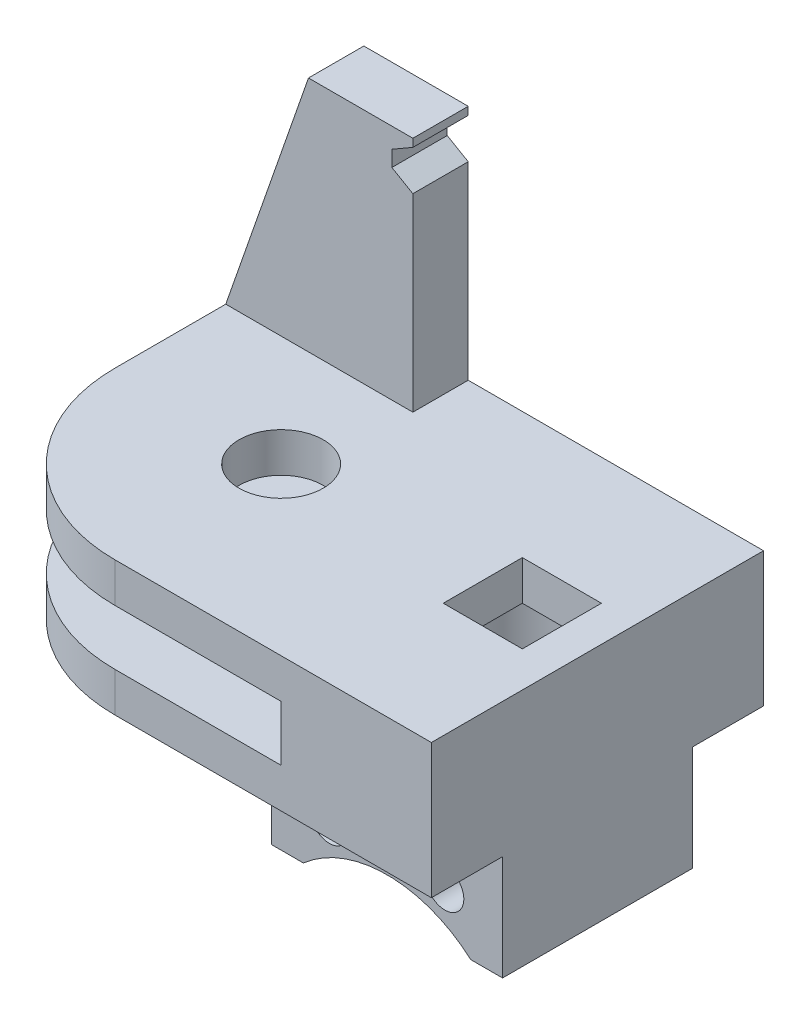
ISO-10303-21;
HEADER;
FILE_DESCRIPTION(('STEP AP214'),'2;1');
FILE_NAME('part.step','',(''),(''),'','','');
FILE_SCHEMA(('AUTOMOTIVE_DESIGN { 1 0 10303 214 1 1 1 1 }'));
ENDSEC;
DATA;
#1=APPLICATION_CONTEXT('core data for automotive mechanical design processes');
#2=APPLICATION_PROTOCOL_DEFINITION('international standard','automotive_design',2000,#1);
#3=PRODUCT_CONTEXT('',#1,'mechanical');
#4=PRODUCT('Part','Part','',(#3));
#5=PRODUCT_RELATED_PRODUCT_CATEGORY('part','',(#4));
#6=PRODUCT_DEFINITION_FORMATION('','',#4);
#7=PRODUCT_DEFINITION_CONTEXT('part definition',#1,'design');
#8=PRODUCT_DEFINITION('design','',#6,#7);
#9=PRODUCT_DEFINITION_SHAPE('','',#8);
#10=(LENGTH_UNIT() NAMED_UNIT(*) SI_UNIT(.MILLI.,.METRE.));
#11=(NAMED_UNIT(*) PLANE_ANGLE_UNIT() SI_UNIT($,.RADIAN.));
#12=(NAMED_UNIT(*) SI_UNIT($,.STERADIAN.) SOLID_ANGLE_UNIT());
#13=UNCERTAINTY_MEASURE_WITH_UNIT(LENGTH_MEASURE(1.E-05),#10,'distance_accuracy_value','');
#14=(GEOMETRIC_REPRESENTATION_CONTEXT(3) GLOBAL_UNCERTAINTY_ASSIGNED_CONTEXT((#13)) GLOBAL_UNIT_ASSIGNED_CONTEXT((#10,
#11,#12)) REPRESENTATION_CONTEXT('',''));
#15=CARTESIAN_POINT('',(0.,0.,0.));
#16=DIRECTION('',(0.,0.,1.));
#17=DIRECTION('',(1.,0.,0.));
#18=AXIS2_PLACEMENT_3D('',#15,#16,#17);
#19=CARTESIAN_POINT('',(1.6891,22.225,-13.335));
#20=DIRECTION('',(-1.,0.,0.));
#21=DIRECTION('',(0.,0.,1.));
#22=AXIS2_PLACEMENT_3D('',#19,#20,#21);
#23=PLANE('',#22);
#24=DIRECTION('',(0.,-1.,0.));
#25=VECTOR('',#24,1.);
#26=CARTESIAN_POINT('',(1.6891,22.225,-8.89));
#27=LINE('',#26,#25);
#28=CARTESIAN_POINT('',(1.6891,22.225,-8.89));
#29=VERTEX_POINT('',#28);
#30=CARTESIAN_POINT('',(1.6891,21.59,-8.89));
#31=VERTEX_POINT('',#30);
#32=EDGE_CURVE('E235',#29,#31,#27,.T.);
#33=ORIENTED_EDGE('',*,*,#32,.T.);
#34=DIRECTION('',(0.,0.,1.));
#35=VECTOR('',#34,1.);
#36=CARTESIAN_POINT('',(1.6891,21.59,-21.59));
#37=LINE('',#36,#35);
#38=CARTESIAN_POINT('',(1.6891,21.59,-13.335));
#39=VERTEX_POINT('',#38);
#40=EDGE_CURVE('E229',#39,#31,#37,.T.);
#41=ORIENTED_EDGE('',*,*,#40,.F.);
#42=DIRECTION('',(0.,-1.,0.));
#43=VECTOR('',#42,1.);
#44=CARTESIAN_POINT('',(1.6891,22.225,-13.335));
#45=LINE('',#44,#43);
#46=CARTESIAN_POINT('',(1.6891,22.225,-13.335));
#47=VERTEX_POINT('',#46);
#48=EDGE_CURVE('E244',#47,#39,#45,.T.);
#49=ORIENTED_EDGE('',*,*,#48,.F.);
#50=DIRECTION('',(0.,0.,-1.));
#51=VECTOR('',#50,1.);
#52=CARTESIAN_POINT('',(1.6891,22.225,-13.335));
#53=LINE('',#52,#51);
#54=EDGE_CURVE('E786',#29,#47,#53,.T.);
#55=ORIENTED_EDGE('',*,*,#54,.F.);
#56=EDGE_LOOP('',(#33,#41,#49,#55));
#57=FACE_BOUND('',#56,.T.);
#58=ADVANCED_FACE('F34',(#57),#23,.F.);
#59=CARTESIAN_POINT('',(0.,3.175,0.));
#60=DIRECTION('',(0.,1.,0.));
#61=DIRECTION('',(0.,0.,1.));
#62=AXIS2_PLACEMENT_3D('',#59,#60,#61);
#63=PLANE('',#62);
#64=DIRECTION('',(0.,0.,-1.));
#65=VECTOR('',#64,1.);
#66=CARTESIAN_POINT('',(22.5425,3.175,3.175));
#67=LINE('',#66,#65);
#68=CARTESIAN_POINT('',(22.5425,3.175,3.175));
#69=VERTEX_POINT('',#68);
#70=CARTESIAN_POINT('',(22.5425,3.175,-3.175));
#71=VERTEX_POINT('',#70);
#72=EDGE_CURVE('E288',#69,#71,#67,.T.);
#73=ORIENTED_EDGE('',*,*,#72,.F.);
#74=DIRECTION('',(1.,0.,0.));
#75=VECTOR('',#74,1.);
#76=CARTESIAN_POINT('',(16.1925,3.175,3.175));
#77=LINE('',#76,#75);
#78=CARTESIAN_POINT('',(16.1925,3.175,3.175));
#79=VERTEX_POINT('',#78);
#80=EDGE_CURVE('E297',#79,#69,#77,.T.);
#81=ORIENTED_EDGE('',*,*,#80,.F.);
#82=DIRECTION('',(0.,0.,1.));
#83=VECTOR('',#82,1.);
#84=CARTESIAN_POINT('',(16.1925,3.175,3.175));
#85=LINE('',#84,#83);
#86=CARTESIAN_POINT('',(16.1925,3.175,-3.175));
#87=VERTEX_POINT('',#86);
#88=EDGE_CURVE('E294',#87,#79,#85,.T.);
#89=ORIENTED_EDGE('',*,*,#88,.F.);
#90=DIRECTION('',(-1.,0.,0.));
#91=VECTOR('',#90,1.);
#92=CARTESIAN_POINT('',(16.1925,3.175,-3.175));
#93=LINE('',#92,#91);
#94=EDGE_CURVE('E291',#71,#87,#93,.T.);
#95=ORIENTED_EDGE('',*,*,#94,.F.);
#96=EDGE_LOOP('',(#73,#81,#89,#95));
#97=FACE_BOUND('',#96,.T.);
#98=CARTESIAN_POINT('',(0.,3.175,0.));
#99=DIRECTION('',(0.,1.,0.));
#100=DIRECTION('',(0.,0.,1.));
#101=AXIS2_PLACEMENT_3D('',#98,#99,#100);
#102=CIRCLE('',#101,3.3782);
#103=CARTESIAN_POINT('',(0.,3.175,3.3782));
#104=VERTEX_POINT('',#103);
#105=EDGE_CURVE('E399',#104,#104,#102,.T.);
#106=ORIENTED_EDGE('',*,*,#105,.F.);
#107=EDGE_LOOP('',(#106));
#108=FACE_BOUND('',#107,.T.);
#109=DIRECTION('',(1.,0.,0.));
#110=VECTOR('',#109,1.);
#111=CARTESIAN_POINT('',(1.6891,3.175,-8.89));
#112=LINE('',#111,#110);
#113=CARTESIAN_POINT('',(-13.335,3.175,-8.89));
#114=VERTEX_POINT('',#113);
#115=CARTESIAN_POINT('',(1.6891,3.175,-8.89));
#116=VERTEX_POINT('',#115);
#117=EDGE_CURVE('E234',#114,#116,#112,.T.);
#118=ORIENTED_EDGE('',*,*,#117,.F.);
#119=DIRECTION('',(0.,0.,1.));
#120=VECTOR('',#119,1.);
#121=CARTESIAN_POINT('',(-13.335,3.175,-13.335));
#122=LINE('',#121,#120);
#123=CARTESIAN_POINT('',(-13.335,3.175,0.));
#124=VERTEX_POINT('',#123);
#125=EDGE_CURVE('E251',#114,#124,#122,.T.);
#126=ORIENTED_EDGE('',*,*,#125,.T.);
#127=CARTESIAN_POINT('',(0.,3.175,0.));
#128=DIRECTION('',(0.,1.,0.));
#129=DIRECTION('',(0.,0.,1.));
#130=AXIS2_PLACEMENT_3D('',#127,#128,#129);
#131=CIRCLE('',#130,13.335);
#132=CARTESIAN_POINT('',(0.,3.175,13.335));
#133=VERTEX_POINT('',#132);
#134=EDGE_CURVE('E405',#124,#133,#131,.T.);
#135=ORIENTED_EDGE('',*,*,#134,.T.);
#136=DIRECTION('',(1.,0.,0.));
#137=VECTOR('',#136,1.);
#138=CARTESIAN_POINT('',(0.,3.175,13.335));
#139=LINE('',#138,#137);
#140=CARTESIAN_POINT('',(25.4,3.175,13.335));
#141=VERTEX_POINT('',#140);
#142=EDGE_CURVE('E407',#133,#141,#139,.T.);
#143=ORIENTED_EDGE('',*,*,#142,.T.);
#144=DIRECTION('',(0.,0.,1.));
#145=VECTOR('',#144,1.);
#146=CARTESIAN_POINT('',(25.4,3.175,0.));
#147=LINE('',#146,#145);
#148=CARTESIAN_POINT('',(25.4,3.175,-13.335));
#149=VERTEX_POINT('',#148);
#150=EDGE_CURVE('E409',#149,#141,#147,.T.);
#151=ORIENTED_EDGE('',*,*,#150,.F.);
#152=DIRECTION('',(1.,0.,0.));
#153=VECTOR('',#152,1.);
#154=CARTESIAN_POINT('',(0.,3.175,-13.335));
#155=LINE('',#154,#153);
#156=CARTESIAN_POINT('',(1.6891,3.175,-13.335));
#157=VERTEX_POINT('',#156);
#158=EDGE_CURVE('E402',#157,#149,#155,.T.);
#159=ORIENTED_EDGE('',*,*,#158,.F.);
#160=DIRECTION('',(0.,0.,-1.));
#161=VECTOR('',#160,1.);
#162=CARTESIAN_POINT('',(1.6891,3.175,-13.335));
#163=LINE('',#162,#161);
#164=EDGE_CURVE('E790',#116,#157,#163,.T.);
#165=ORIENTED_EDGE('',*,*,#164,.F.);
#166=EDGE_LOOP('',(#118,#126,#135,#143,#151,#159,#165));
#167=FACE_BOUND('',#166,.T.);
#168=ADVANCED_FACE('F485',(#97,#108,#167),#63,.T.);
#169=CARTESIAN_POINT('',(0.,-16.05915,0.));
#170=DIRECTION('',(0.,-1.,0.));
#171=DIRECTION('',(0.,0.,-1.));
#172=AXIS2_PLACEMENT_3D('',#169,#170,#171);
#173=PLANE('',#172);
#174=DIRECTION('',(0.,0.,-1.));
#175=VECTOR('',#174,1.);
#176=CARTESIAN_POINT('',(9.40879166989593,-16.05915,13.335));
#177=LINE('',#176,#175);
#178=CARTESIAN_POINT('',(9.40879166989593,-16.05915,7.62000000000001));
#179=VERTEX_POINT('',#178);
#180=CARTESIAN_POINT('',(9.40879166989593,-16.05915,-7.62));
#181=VERTEX_POINT('',#180);
#182=EDGE_CURVE('E42',#179,#181,#177,.T.);
#183=ORIENTED_EDGE('',*,*,#182,.F.);
#184=DIRECTION('',(-1.,0.,0.));
#185=VECTOR('',#184,1.);
#186=CARTESIAN_POINT('',(25.4,-16.05915,7.62000000000001));
#187=LINE('',#186,#185);
#188=CARTESIAN_POINT('',(6.858,-16.05915,7.62000000000001));
#189=VERTEX_POINT('',#188);
#190=EDGE_CURVE('E329',#179,#189,#187,.T.);
#191=ORIENTED_EDGE('',*,*,#190,.T.);
#192=DIRECTION('',(0.,0.,-1.));
#193=VECTOR('',#192,1.);
#194=CARTESIAN_POINT('',(6.858,-16.05915,-7.62000000000001));
#195=LINE('',#194,#193);
#196=CARTESIAN_POINT('',(6.858,-16.05915,-7.62000000000001));
#197=VERTEX_POINT('',#196);
#198=EDGE_CURVE('E334',#189,#197,#195,.T.);
#199=ORIENTED_EDGE('',*,*,#198,.T.);
#200=DIRECTION('',(1.,0.,0.));
#201=VECTOR('',#200,1.);
#202=CARTESIAN_POINT('',(25.4,-16.05915,-7.62));
#203=LINE('',#202,#201);
#204=EDGE_CURVE('E337',#197,#181,#203,.T.);
#205=ORIENTED_EDGE('',*,*,#204,.T.);
#206=EDGE_LOOP('',(#183,#191,#199,#205));
#207=FACE_BOUND('',#206,.T.);
#208=ADVANCED_FACE('F442',(#207),#173,.T.);
#209=CARTESIAN_POINT('',(0.,3.175,-13.335));
#210=DIRECTION('',(0.,0.,-1.));
#211=DIRECTION('',(-1.,0.,0.));
#212=AXIS2_PLACEMENT_3D('',#209,#210,#211);
#213=PLANE('',#212);
#214=DIRECTION('',(0.866025403784441,0.499999999999997,0.));
#215=VECTOR('',#214,1.);
#216=CARTESIAN_POINT('',(-7.55165390534519,16.2548482452339,-13.335));
#217=LINE('',#216,#215);
#218=CARTESIAN_POINT('',(0.,20.6147976603118,-13.335));
#219=VERTEX_POINT('',#218);
#220=EDGE_CURVE('E767',#219,#39,#217,.T.);
#221=ORIENTED_EDGE('',*,*,#220,.F.);
#222=DIRECTION('',(0.,1.,0.));
#223=VECTOR('',#222,1.);
#224=CARTESIAN_POINT('',(0.,3.175,-13.335));
#225=LINE('',#224,#223);
#226=CARTESIAN_POINT('',(0.,19.3447976603118,-13.335));
#227=VERTEX_POINT('',#226);
#228=EDGE_CURVE('E773',#227,#219,#225,.T.);
#229=ORIENTED_EDGE('',*,*,#228,.F.);
#230=DIRECTION('',(-0.866025403784436,0.500000000000005,0.));
#231=VECTOR('',#230,1.);
#232=CARTESIAN_POINT('',(7.00172777394215,15.3023482452338,-13.335));
#233=LINE('',#232,#231);
#234=CARTESIAN_POINT('',(1.6891,18.3695953206236,-13.335));
#235=VERTEX_POINT('',#234);
#236=EDGE_CURVE('E774',#235,#227,#233,.T.);
#237=ORIENTED_EDGE('',*,*,#236,.F.);
#238=EDGE_CURVE('E228',#235,#157,#45,.T.);
#239=ORIENTED_EDGE('',*,*,#238,.T.);
#240=ORIENTED_EDGE('',*,*,#158,.T.);
#241=DIRECTION('',(0.,-1.,0.));
#242=VECTOR('',#241,1.);
#243=CARTESIAN_POINT('',(25.4,3.175,-13.335));
#244=LINE('',#243,#242);
#245=CARTESIAN_POINT('',(25.4,-7.62,-13.335));
#246=VERTEX_POINT('',#245);
#247=EDGE_CURVE('E412',#149,#246,#244,.T.);
#248=ORIENTED_EDGE('',*,*,#247,.T.);
#249=DIRECTION('',(1.,0.,0.));
#250=VECTOR('',#249,1.);
#251=CARTESIAN_POINT('',(0.,-7.62,-13.335));
#252=LINE('',#251,#250);
#253=CARTESIAN_POINT('',(-13.335,-7.62,-13.335));
#254=VERTEX_POINT('',#253);
#255=EDGE_CURVE('E363',#254,#246,#252,.T.);
#256=ORIENTED_EDGE('',*,*,#255,.F.);
#257=DIRECTION('',(0.,-1.,0.));
#258=VECTOR('',#257,1.);
#259=CARTESIAN_POINT('',(-13.335,14.4135378542452,-13.335));
#260=LINE('',#259,#258);
#261=CARTESIAN_POINT('',(-13.335,-4.445,-13.335));
#262=VERTEX_POINT('',#261);
#263=EDGE_CURVE('E252',#262,#254,#260,.T.);
#264=ORIENTED_EDGE('',*,*,#263,.F.);
#265=DIRECTION('',(1.,0.,0.));
#266=VECTOR('',#265,1.);
#267=CARTESIAN_POINT('',(0.,-4.445,-13.335));
#268=LINE('',#267,#266);
#269=CARTESIAN_POINT('',(13.335,-4.445,-13.335));
#270=VERTEX_POINT('',#269);
#271=EDGE_CURVE('E378',#262,#270,#268,.T.);
#272=ORIENTED_EDGE('',*,*,#271,.T.);
#273=DIRECTION('',(0.,1.,0.));
#274=VECTOR('',#273,1.);
#275=CARTESIAN_POINT('',(13.335,-4.445,-13.335));
#276=LINE('',#275,#274);
#277=CARTESIAN_POINT('',(13.335,0.,-13.335));
#278=VERTEX_POINT('',#277);
#279=EDGE_CURVE('E391',#270,#278,#276,.T.);
#280=ORIENTED_EDGE('',*,*,#279,.T.);
#281=DIRECTION('',(1.,0.,0.));
#282=VECTOR('',#281,1.);
#283=CARTESIAN_POINT('',(0.,0.,-13.335));
#284=LINE('',#283,#282);
#285=CARTESIAN_POINT('',(-13.335,0.,-13.335));
#286=VERTEX_POINT('',#285);
#287=EDGE_CURVE('E415',#286,#278,#284,.T.);
#288=ORIENTED_EDGE('',*,*,#287,.F.);
#289=DIRECTION('',(0.,1.,0.));
#290=VECTOR('',#289,1.);
#291=CARTESIAN_POINT('',(-13.335,-18.8585378542452,-13.335));
#292=LINE('',#291,#290);
#293=CARTESIAN_POINT('',(-13.335,3.175,-13.335));
#294=VERTEX_POINT('',#293);
#295=EDGE_CURVE('E263',#286,#294,#292,.T.);
#296=ORIENTED_EDGE('',*,*,#295,.T.);
#297=DIRECTION('',(-0.329228587622184,-0.944250251306454,0.));
#298=VECTOR('',#297,1.);
#299=CARTESIAN_POINT('',(-6.6929,22.225,-13.335));
#300=LINE('',#299,#298);
#301=CARTESIAN_POINT('',(-6.6929,22.225,-13.335));
#302=VERTEX_POINT('',#301);
#303=EDGE_CURVE('E783',#302,#294,#300,.T.);
#304=ORIENTED_EDGE('',*,*,#303,.F.);
#305=DIRECTION('',(-1.,0.,0.));
#306=VECTOR('',#305,1.);
#307=CARTESIAN_POINT('',(1.6891,22.225,-13.335));
#308=LINE('',#307,#306);
#309=EDGE_CURVE('E781',#47,#302,#308,.T.);
#310=ORIENTED_EDGE('',*,*,#309,.F.);
#311=ORIENTED_EDGE('',*,*,#48,.T.);
#312=EDGE_LOOP('',(#221,#229,#237,#239,#240,#248,#256,#264,#272,#280,#288,#296,#304,#310,#311));
#313=FACE_BOUND('',#312,.T.);
#314=ADVANCED_FACE('F482',(#313),#213,.T.);
#315=CARTESIAN_POINT('',(0.,3.175,0.));
#316=DIRECTION('',(0.,-1.,0.));
#317=DIRECTION('',(0.,0.,-1.));
#318=AXIS2_PLACEMENT_3D('',#315,#316,#317);
#319=CYLINDRICAL_SURFACE('',#318,13.335);
#320=ORIENTED_EDGE('',*,*,#134,.F.);
#321=DIRECTION('',(0.,1.,0.));
#322=VECTOR('',#321,1.);
#323=CARTESIAN_POINT('',(-13.335,-18.8585378542452,0.));
#324=LINE('',#323,#322);
#325=CARTESIAN_POINT('',(-13.335,0.,0.));
#326=VERTEX_POINT('',#325);
#327=EDGE_CURVE('E264',#326,#124,#324,.T.);
#328=ORIENTED_EDGE('',*,*,#327,.F.);
#329=CARTESIAN_POINT('',(0.,0.,0.));
#330=DIRECTION('',(0.,1.,0.));
#331=DIRECTION('',(0.,0.,1.));
#332=AXIS2_PLACEMENT_3D('',#329,#330,#331);
#333=CIRCLE('',#332,13.335);
#334=CARTESIAN_POINT('',(0.,0.,13.335));
#335=VERTEX_POINT('',#334);
#336=EDGE_CURVE('E418',#326,#335,#333,.T.);
#337=ORIENTED_EDGE('',*,*,#336,.T.);
#338=DIRECTION('',(0.,-1.,0.));
#339=VECTOR('',#338,1.);
#340=CARTESIAN_POINT('',(0.,3.175,13.335));
#341=LINE('',#340,#339);
#342=EDGE_CURVE('E426',#133,#335,#341,.T.);
#343=ORIENTED_EDGE('',*,*,#342,.F.);
#344=EDGE_LOOP('',(#320,#328,#337,#343));
#345=FACE_BOUND('',#344,.T.);
#346=ADVANCED_FACE('F489',(#345),#319,.T.);
#347=CARTESIAN_POINT('',(0.,3.175,13.335));
#348=DIRECTION('',(0.,0.,-1.));
#349=DIRECTION('',(-1.,0.,0.));
#350=AXIS2_PLACEMENT_3D('',#347,#348,#349);
#351=PLANE('',#350);
#352=DIRECTION('',(1.,0.,0.));
#353=VECTOR('',#352,1.);
#354=CARTESIAN_POINT('',(0.,0.,13.335));
#355=LINE('',#354,#353);
#356=CARTESIAN_POINT('',(13.335,0.,13.335));
#357=VERTEX_POINT('',#356);
#358=EDGE_CURVE('E403',#335,#357,#355,.T.);
#359=ORIENTED_EDGE('',*,*,#358,.T.);
#360=DIRECTION('',(0.,1.,0.));
#361=VECTOR('',#360,1.);
#362=CARTESIAN_POINT('',(13.335,-4.445,13.335));
#363=LINE('',#362,#361);
#364=CARTESIAN_POINT('',(13.335,-4.445,13.335));
#365=VERTEX_POINT('',#364);
#366=EDGE_CURVE('E394',#365,#357,#363,.T.);
#367=ORIENTED_EDGE('',*,*,#366,.F.);
#368=DIRECTION('',(1.,0.,0.));
#369=VECTOR('',#368,1.);
#370=CARTESIAN_POINT('',(0.,-4.445,13.335));
#371=LINE('',#370,#369);
#372=CARTESIAN_POINT('',(0.,-4.445,13.335));
#373=VERTEX_POINT('',#372);
#374=EDGE_CURVE('E381',#373,#365,#371,.T.);
#375=ORIENTED_EDGE('',*,*,#374,.F.);
#376=DIRECTION('',(0.,1.,0.));
#377=VECTOR('',#376,1.);
#378=CARTESIAN_POINT('',(0.,-7.62,13.335));
#379=LINE('',#378,#377);
#380=CARTESIAN_POINT('',(0.,-7.62,13.335));
#381=VERTEX_POINT('',#380);
#382=EDGE_CURVE('E375',#381,#373,#379,.T.);
#383=ORIENTED_EDGE('',*,*,#382,.F.);
#384=DIRECTION('',(1.,0.,0.));
#385=VECTOR('',#384,1.);
#386=CARTESIAN_POINT('',(0.,-7.62,13.335));
#387=LINE('',#386,#385);
#388=CARTESIAN_POINT('',(25.4,-7.62,13.335));
#389=VERTEX_POINT('',#388);
#390=EDGE_CURVE('E370',#381,#389,#387,.T.);
#391=ORIENTED_EDGE('',*,*,#390,.T.);
#392=DIRECTION('',(0.,-1.,0.));
#393=VECTOR('',#392,1.);
#394=CARTESIAN_POINT('',(25.4,3.175,13.335));
#395=LINE('',#394,#393);
#396=EDGE_CURVE('E423',#141,#389,#395,.T.);
#397=ORIENTED_EDGE('',*,*,#396,.F.);
#398=ORIENTED_EDGE('',*,*,#142,.F.);
#399=ORIENTED_EDGE('',*,*,#342,.T.);
#400=EDGE_LOOP('',(#359,#367,#375,#383,#391,#397,#398,#399));
#401=FACE_BOUND('',#400,.T.);
#402=ADVANCED_FACE('F469',(#401),#351,.F.);
#403=CARTESIAN_POINT('',(0.,3.175,0.));
#404=DIRECTION('',(0.,-1.,0.));
#405=DIRECTION('',(0.,0.,-1.));
#406=AXIS2_PLACEMENT_3D('',#403,#404,#405);
#407=CYLINDRICAL_SURFACE('',#406,3.3782);
#408=ORIENTED_EDGE('',*,*,#105,.T.);
#409=EDGE_LOOP('',(#408));
#410=FACE_BOUND('',#409,.T.);
#411=CARTESIAN_POINT('',(0.,0.,0.));
#412=DIRECTION('',(0.,1.,0.));
#413=DIRECTION('',(0.,0.,1.));
#414=AXIS2_PLACEMENT_3D('',#411,#412,#413);
#415=CIRCLE('',#414,3.3782);
#416=CARTESIAN_POINT('',(0.,0.,3.3782));
#417=VERTEX_POINT('',#416);
#418=EDGE_CURVE('E396',#417,#417,#415,.T.);
#419=ORIENTED_EDGE('',*,*,#418,.F.);
#420=EDGE_LOOP('',(#419));
#421=FACE_BOUND('',#420,.T.);
#422=ADVANCED_FACE('F36',(#410,#421),#407,.F.);
#423=CARTESIAN_POINT('',(25.4,3.175,0.));
#424=DIRECTION('',(1.,0.,0.));
#425=DIRECTION('',(0.,0.,-1.));
#426=AXIS2_PLACEMENT_3D('',#423,#424,#425);
#427=PLANE('',#426);
#428=ORIENTED_EDGE('',*,*,#396,.T.);
#429=DIRECTION('',(0.,0.,1.));
#430=VECTOR('',#429,1.);
#431=CARTESIAN_POINT('',(25.4,-7.62,0.));
#432=LINE('',#431,#430);
#433=CARTESIAN_POINT('',(25.4,-7.62,7.62000000000001));
#434=VERTEX_POINT('',#433);
#435=EDGE_CURVE('E367',#434,#389,#432,.T.);
#436=ORIENTED_EDGE('',*,*,#435,.F.);
#437=DIRECTION('',(0.,1.,0.));
#438=VECTOR('',#437,1.);
#439=CARTESIAN_POINT('',(25.4,-16.05915,7.62000000000001));
#440=LINE('',#439,#438);
#441=CARTESIAN_POINT('',(25.4,-16.05915,7.62000000000001));
#442=VERTEX_POINT('',#441);
#443=EDGE_CURVE('E356',#442,#434,#440,.T.);
#444=ORIENTED_EDGE('',*,*,#443,.F.);
#445=DIRECTION('',(0.,0.,1.));
#446=VECTOR('',#445,1.);
#447=CARTESIAN_POINT('',(25.4,-16.05915,-7.62));
#448=LINE('',#447,#446);
#449=CARTESIAN_POINT('',(25.4,-16.05915,-7.62));
#450=VERTEX_POINT('',#449);
#451=EDGE_CURVE('E326',#450,#442,#448,.T.);
#452=ORIENTED_EDGE('',*,*,#451,.F.);
#453=DIRECTION('',(0.,1.,0.));
#454=VECTOR('',#453,1.);
#455=CARTESIAN_POINT('',(25.4,-16.05915,-7.62));
#456=LINE('',#455,#454);
#457=CARTESIAN_POINT('',(25.4,-7.62,-7.62));
#458=VERTEX_POINT('',#457);
#459=EDGE_CURVE('E340',#450,#458,#456,.T.);
#460=ORIENTED_EDGE('',*,*,#459,.T.);
#461=EDGE_CURVE('E368',#246,#458,#432,.T.);
#462=ORIENTED_EDGE('',*,*,#461,.F.);
#463=ORIENTED_EDGE('',*,*,#247,.F.);
#464=ORIENTED_EDGE('',*,*,#150,.T.);
#465=EDGE_LOOP('',(#428,#436,#444,#452,#460,#462,#463,#464));
#466=FACE_BOUND('',#465,.T.);
#467=ADVANCED_FACE('F452',(#466),#427,.T.);
#468=CARTESIAN_POINT('',(0.,0.,0.));
#469=DIRECTION('',(0.,1.,0.));
#470=DIRECTION('',(0.,0.,1.));
#471=AXIS2_PLACEMENT_3D('',#468,#469,#470);
#472=PLANE('',#471);
#473=ORIENTED_EDGE('',*,*,#418,.T.);
#474=EDGE_LOOP('',(#473));
#475=FACE_BOUND('',#474,.T.);
#476=ORIENTED_EDGE('',*,*,#336,.F.);
#477=DIRECTION('',(0.,0.,-1.));
#478=VECTOR('',#477,1.);
#479=CARTESIAN_POINT('',(-13.335,0.,-13.335));
#480=LINE('',#479,#478);
#481=EDGE_CURVE('E267',#326,#286,#480,.T.);
#482=ORIENTED_EDGE('',*,*,#481,.T.);
#483=ORIENTED_EDGE('',*,*,#287,.T.);
#484=DIRECTION('',(0.,0.,1.));
#485=VECTOR('',#484,1.);
#486=CARTESIAN_POINT('',(13.335,0.,0.));
#487=LINE('',#486,#485);
#488=EDGE_CURVE('E387',#278,#357,#487,.T.);
#489=ORIENTED_EDGE('',*,*,#488,.T.);
#490=ORIENTED_EDGE('',*,*,#358,.F.);
#491=EDGE_LOOP('',(#476,#482,#483,#489,#490));
#492=FACE_BOUND('',#491,.T.);
#493=ADVANCED_FACE('F494',(#475,#492),#472,.F.);
#494=CARTESIAN_POINT('',(13.335,-4.445,0.));
#495=DIRECTION('',(-1.,0.,0.));
#496=DIRECTION('',(0.,0.,1.));
#497=AXIS2_PLACEMENT_3D('',#494,#495,#496);
#498=PLANE('',#497);
#499=ORIENTED_EDGE('',*,*,#488,.F.);
#500=ORIENTED_EDGE('',*,*,#279,.F.);
#501=DIRECTION('',(0.,0.,-1.));
#502=VECTOR('',#501,1.);
#503=CARTESIAN_POINT('',(13.335,-4.445,0.));
#504=LINE('',#503,#502);
#505=EDGE_CURVE('E388',#365,#270,#504,.T.);
#506=ORIENTED_EDGE('',*,*,#505,.F.);
#507=ORIENTED_EDGE('',*,*,#366,.T.);
#508=EDGE_LOOP('',(#499,#500,#506,#507));
#509=FACE_BOUND('',#508,.T.);
#510=ADVANCED_FACE('F497',(#509),#498,.T.);
#511=CARTESIAN_POINT('',(0.,-4.445,0.));
#512=DIRECTION('',(0.,-1.,0.));
#513=DIRECTION('',(0.,0.,1.));
#514=AXIS2_PLACEMENT_3D('',#511,#512,#513);
#515=PLANE('',#514);
#516=CARTESIAN_POINT('',(0.,-4.445,0.));
#517=DIRECTION('',(0.,1.,0.));
#518=DIRECTION('',(0.,0.,1.));
#519=AXIS2_PLACEMENT_3D('',#516,#517,#518);
#520=CIRCLE('',#519,3.3782);
#521=CARTESIAN_POINT('',(0.,-4.445,3.3782));
#522=VERTEX_POINT('',#521);
#523=EDGE_CURVE('E359',#522,#522,#520,.T.);
#524=ORIENTED_EDGE('',*,*,#523,.F.);
#525=EDGE_LOOP('',(#524));
#526=FACE_BOUND('',#525,.T.);
#527=ORIENTED_EDGE('',*,*,#271,.F.);
#528=DIRECTION('',(0.,0.,1.));
#529=VECTOR('',#528,1.);
#530=CARTESIAN_POINT('',(-13.335,-4.445,-13.335));
#531=LINE('',#530,#529);
#532=CARTESIAN_POINT('',(-13.335,-4.445,0.));
#533=VERTEX_POINT('',#532);
#534=EDGE_CURVE('E248',#262,#533,#531,.T.);
#535=ORIENTED_EDGE('',*,*,#534,.T.);
#536=CARTESIAN_POINT('',(0.,-4.445,0.));
#537=DIRECTION('',(0.,1.,0.));
#538=DIRECTION('',(0.,0.,1.));
#539=AXIS2_PLACEMENT_3D('',#536,#537,#538);
#540=CIRCLE('',#539,13.335);
#541=EDGE_CURVE('E364',#533,#373,#540,.T.);
#542=ORIENTED_EDGE('',*,*,#541,.T.);
#543=ORIENTED_EDGE('',*,*,#374,.T.);
#544=ORIENTED_EDGE('',*,*,#505,.T.);
#545=EDGE_LOOP('',(#527,#535,#542,#543,#544));
#546=FACE_BOUND('',#545,.T.);
#547=ADVANCED_FACE('F479',(#526,#546),#515,.F.);
#548=CARTESIAN_POINT('',(0.,-7.62,0.));
#549=DIRECTION('',(0.,1.,0.));
#550=DIRECTION('',(0.,0.,1.));
#551=AXIS2_PLACEMENT_3D('',#548,#549,#550);
#552=CYLINDRICAL_SURFACE('',#551,3.3782);
#553=CARTESIAN_POINT('',(0.,-7.62,0.));
#554=DIRECTION('',(0.,1.,0.));
#555=DIRECTION('',(0.,0.,1.));
#556=AXIS2_PLACEMENT_3D('',#553,#554,#555);
#557=CIRCLE('',#556,3.3782);
#558=CARTESIAN_POINT('',(0.,-7.62,3.3782));
#559=VERTEX_POINT('',#558);
#560=EDGE_CURVE('E360',#559,#559,#557,.T.);
#561=ORIENTED_EDGE('',*,*,#560,.F.);
#562=EDGE_LOOP('',(#561));
#563=FACE_BOUND('',#562,.T.);
#564=ORIENTED_EDGE('',*,*,#523,.T.);
#565=EDGE_LOOP('',(#564));
#566=FACE_BOUND('',#565,.T.);
#567=ADVANCED_FACE('F504',(#563,#566),#552,.F.);
#568=CARTESIAN_POINT('',(0.,-7.62,0.));
#569=DIRECTION('',(0.,1.,0.));
#570=DIRECTION('',(0.,0.,1.));
#571=AXIS2_PLACEMENT_3D('',#568,#569,#570);
#572=CYLINDRICAL_SURFACE('',#571,13.335);
#573=DIRECTION('',(0.,-1.,0.));
#574=VECTOR('',#573,1.);
#575=CARTESIAN_POINT('',(-13.335,14.4135378542452,0.));
#576=LINE('',#575,#574);
#577=CARTESIAN_POINT('',(-13.335,-7.62,0.));
#578=VERTEX_POINT('',#577);
#579=EDGE_CURVE('E255',#533,#578,#576,.T.);
#580=ORIENTED_EDGE('',*,*,#579,.T.);
#581=CARTESIAN_POINT('',(0.,-7.62,0.));
#582=DIRECTION('',(0.,1.,0.));
#583=DIRECTION('',(0.,0.,1.));
#584=AXIS2_PLACEMENT_3D('',#581,#582,#583);
#585=CIRCLE('',#584,13.335);
#586=EDGE_CURVE('E373',#578,#381,#585,.T.);
#587=ORIENTED_EDGE('',*,*,#586,.T.);
#588=ORIENTED_EDGE('',*,*,#382,.T.);
#589=ORIENTED_EDGE('',*,*,#541,.F.);
#590=EDGE_LOOP('',(#580,#587,#588,#589));
#591=FACE_BOUND('',#590,.T.);
#592=ADVANCED_FACE('F472',(#591),#572,.T.);
#593=CARTESIAN_POINT('',(0.,-7.62,0.));
#594=DIRECTION('',(0.,-1.,0.));
#595=DIRECTION('',(0.,0.,1.));
#596=AXIS2_PLACEMENT_3D('',#593,#594,#595);
#597=PLANE('',#596);
#598=ORIENTED_EDGE('',*,*,#586,.F.);
#599=DIRECTION('',(0.,0.,-1.));
#600=VECTOR('',#599,1.);
#601=CARTESIAN_POINT('',(-13.335,-7.62,-13.335));
#602=LINE('',#601,#600);
#603=EDGE_CURVE('E247',#578,#254,#602,.T.);
#604=ORIENTED_EDGE('',*,*,#603,.T.);
#605=ORIENTED_EDGE('',*,*,#255,.T.);
#606=ORIENTED_EDGE('',*,*,#461,.T.);
#607=DIRECTION('',(1.,0.,0.));
#608=VECTOR('',#607,1.);
#609=CARTESIAN_POINT('',(25.4,-7.62,-7.62));
#610=LINE('',#609,#608);
#611=CARTESIAN_POINT('',(6.858,-7.62,-7.62000000000001));
#612=VERTEX_POINT('',#611);
#613=EDGE_CURVE('E330',#612,#458,#610,.T.);
#614=ORIENTED_EDGE('',*,*,#613,.F.);
#615=DIRECTION('',(0.,0.,-1.));
#616=VECTOR('',#615,1.);
#617=CARTESIAN_POINT('',(6.858,-7.62,-7.62000000000001));
#618=LINE('',#617,#616);
#619=CARTESIAN_POINT('',(6.858,-7.62,7.62000000000001));
#620=VERTEX_POINT('',#619);
#621=EDGE_CURVE('E343',#620,#612,#618,.T.);
#622=ORIENTED_EDGE('',*,*,#621,.F.);
#623=DIRECTION('',(-1.,0.,0.));
#624=VECTOR('',#623,1.);
#625=CARTESIAN_POINT('',(25.4,-7.62,7.62000000000001));
#626=LINE('',#625,#624);
#627=EDGE_CURVE('E325',#434,#620,#626,.T.);
#628=ORIENTED_EDGE('',*,*,#627,.F.);
#629=ORIENTED_EDGE('',*,*,#435,.T.);
#630=ORIENTED_EDGE('',*,*,#390,.F.);
#631=EDGE_LOOP('',(#598,#604,#605,#606,#614,#622,#628,#629,#630));
#632=FACE_BOUND('',#631,.T.);
#633=ORIENTED_EDGE('',*,*,#560,.T.);
#634=EDGE_LOOP('',(#633));
#635=FACE_BOUND('',#634,.T.);
#636=ADVANCED_FACE('F461',(#632,#635),#597,.T.);
#637=CARTESIAN_POINT('',(25.4,-16.05915,7.62000000000001));
#638=DIRECTION('',(0.,0.,-1.));
#639=DIRECTION('',(-1.,0.,0.));
#640=AXIS2_PLACEMENT_3D('',#637,#638,#639);
#641=PLANE('',#640);
#642=CARTESIAN_POINT('',(20.7645,-12.1285,7.62000000000001));
#643=DIRECTION('',(0.,0.,-1.));
#644=DIRECTION('',(-1.,0.,0.));
#645=AXIS2_PLACEMENT_3D('',#642,#643,#644);
#646=CIRCLE('',#645,1.524);
#647=CARTESIAN_POINT('',(19.2405,-12.1285,7.62000000000001));
#648=VERTEX_POINT('',#647);
#649=EDGE_CURVE('E322',#648,#648,#646,.T.);
#650=ORIENTED_EDGE('',*,*,#649,.T.);
#651=EDGE_LOOP('',(#650));
#652=FACE_BOUND('',#651,.T.);
#653=CARTESIAN_POINT('',(11.4935,-12.1285,7.62000000000001));
#654=DIRECTION('',(0.,0.,-1.));
#655=DIRECTION('',(-1.,0.,0.));
#656=AXIS2_PLACEMENT_3D('',#653,#654,#655);
#657=CIRCLE('',#656,1.524);
#658=CARTESIAN_POINT('',(9.9695,-12.1285,7.62000000000001));
#659=VERTEX_POINT('',#658);
#660=EDGE_CURVE('E317',#659,#659,#657,.T.);
#661=ORIENTED_EDGE('',*,*,#660,.T.);
#662=EDGE_LOOP('',(#661));
#663=FACE_BOUND('',#662,.T.);
#664=ORIENTED_EDGE('',*,*,#190,.F.);
#665=CARTESIAN_POINT('',(16.129,-23.67915,7.62000000000001));
#666=DIRECTION('',(0.,0.,-1.));
#667=DIRECTION('',(-1.,0.,0.));
#668=AXIS2_PLACEMENT_3D('',#665,#666,#667);
#669=CIRCLE('',#668,10.16);
#670=CARTESIAN_POINT('',(22.8492083301041,-16.05915,7.62000000000001));
#671=VERTEX_POINT('',#670);
#672=EDGE_CURVE('E310',#179,#671,#669,.T.);
#673=ORIENTED_EDGE('',*,*,#672,.T.);
#674=EDGE_CURVE('E331',#442,#671,#187,.T.);
#675=ORIENTED_EDGE('',*,*,#674,.F.);
#676=ORIENTED_EDGE('',*,*,#443,.T.);
#677=ORIENTED_EDGE('',*,*,#627,.T.);
#678=DIRECTION('',(0.,1.,0.));
#679=VECTOR('',#678,1.);
#680=CARTESIAN_POINT('',(6.858,-16.05915,7.62000000000001));
#681=LINE('',#680,#679);
#682=EDGE_CURVE('E353',#189,#620,#681,.T.);
#683=ORIENTED_EDGE('',*,*,#682,.F.);
#684=EDGE_LOOP('',(#664,#673,#675,#676,#677,#683));
#685=FACE_BOUND('',#684,.T.);
#686=ADVANCED_FACE('F459',(#652,#663,#685),#641,.F.);
#687=CARTESIAN_POINT('',(6.858,-16.05915,-7.62000000000001));
#688=DIRECTION('',(1.,0.,0.));
#689=DIRECTION('',(0.,0.,-1.));
#690=AXIS2_PLACEMENT_3D('',#687,#688,#689);
#691=PLANE('',#690);
#692=ORIENTED_EDGE('',*,*,#621,.T.);
#693=DIRECTION('',(0.,1.,0.));
#694=VECTOR('',#693,1.);
#695=CARTESIAN_POINT('',(6.858,-16.05915,-7.62000000000001));
#696=LINE('',#695,#694);
#697=EDGE_CURVE('E350',#197,#612,#696,.T.);
#698=ORIENTED_EDGE('',*,*,#697,.F.);
#699=ORIENTED_EDGE('',*,*,#198,.F.);
#700=ORIENTED_EDGE('',*,*,#682,.T.);
#701=EDGE_LOOP('',(#692,#698,#699,#700));
#702=FACE_BOUND('',#701,.T.);
#703=ADVANCED_FACE('F447',(#702),#691,.F.);
#704=CARTESIAN_POINT('',(25.4,-16.05915,-7.62));
#705=DIRECTION('',(0.,0.,1.));
#706=DIRECTION('',(1.,0.,0.));
#707=AXIS2_PLACEMENT_3D('',#704,#705,#706);
#708=PLANE('',#707);
#709=CARTESIAN_POINT('',(20.7645,-12.1285,-7.62));
#710=DIRECTION('',(0.,0.,-1.));
#711=DIRECTION('',(-1.,0.,0.));
#712=AXIS2_PLACEMENT_3D('',#709,#710,#711);
#713=CIRCLE('',#712,1.524);
#714=CARTESIAN_POINT('',(19.2405,-12.1285,-7.62));
#715=VERTEX_POINT('',#714);
#716=EDGE_CURVE('E314',#715,#715,#713,.T.);
#717=ORIENTED_EDGE('',*,*,#716,.F.);
#718=EDGE_LOOP('',(#717));
#719=FACE_BOUND('',#718,.T.);
#720=CARTESIAN_POINT('',(11.4935,-12.1285,-7.62));
#721=DIRECTION('',(0.,0.,-1.));
#722=DIRECTION('',(1.,0.,0.));
#723=AXIS2_PLACEMENT_3D('',#720,#721,#722);
#724=CIRCLE('',#723,1.524);
#725=CARTESIAN_POINT('',(13.0175,-12.1285,-7.62));
#726=VERTEX_POINT('',#725);
#727=EDGE_CURVE('E313',#726,#726,#724,.T.);
#728=ORIENTED_EDGE('',*,*,#727,.F.);
#729=EDGE_LOOP('',(#728));
#730=FACE_BOUND('',#729,.T.);
#731=CARTESIAN_POINT('',(22.8492083301041,-16.05915,-7.62));
#732=VERTEX_POINT('',#731);
#733=EDGE_CURVE('E336',#732,#450,#203,.T.);
#734=ORIENTED_EDGE('',*,*,#733,.F.);
#735=CARTESIAN_POINT('',(16.129,-23.67915,-7.62));
#736=DIRECTION('',(0.,0.,-1.));
#737=DIRECTION('',(-1.,0.,0.));
#738=AXIS2_PLACEMENT_3D('',#735,#736,#737);
#739=CIRCLE('',#738,10.16);
#740=EDGE_CURVE('E303',#181,#732,#739,.T.);
#741=ORIENTED_EDGE('',*,*,#740,.F.);
#742=ORIENTED_EDGE('',*,*,#204,.F.);
#743=ORIENTED_EDGE('',*,*,#697,.T.);
#744=ORIENTED_EDGE('',*,*,#613,.T.);
#745=ORIENTED_EDGE('',*,*,#459,.F.);
#746=EDGE_LOOP('',(#734,#741,#742,#743,#744,#745));
#747=FACE_BOUND('',#746,.T.);
#748=ADVANCED_FACE('F440',(#719,#730,#747),#708,.F.);
#749=DIRECTION('',(0.,0.,-1.));
#750=VECTOR('',#749,1.);
#751=CARTESIAN_POINT('',(22.8492083301041,-16.05915,13.335));
#752=LINE('',#751,#750);
#753=EDGE_CURVE('E429',#732,#671,#752,.F.);
#754=ORIENTED_EDGE('',*,*,#753,.F.);
#755=ORIENTED_EDGE('',*,*,#733,.T.);
#756=ORIENTED_EDGE('',*,*,#451,.T.);
#757=ORIENTED_EDGE('',*,*,#674,.T.);
#758=EDGE_LOOP('',(#754,#755,#756,#757));
#759=FACE_BOUND('',#758,.T.);
#760=ADVANCED_FACE('F457',(#759),#173,.T.);
#761=CARTESIAN_POINT('',(11.4935,-12.1285,13.335));
#762=DIRECTION('',(0.,0.,-1.));
#763=DIRECTION('',(-1.,0.,0.));
#764=AXIS2_PLACEMENT_3D('',#761,#762,#763);
#765=CYLINDRICAL_SURFACE('',#764,1.524);
#766=ORIENTED_EDGE('',*,*,#727,.T.);
#767=EDGE_LOOP('',(#766));
#768=FACE_BOUND('',#767,.T.);
#769=ORIENTED_EDGE('',*,*,#660,.F.);
#770=EDGE_LOOP('',(#769));
#771=FACE_BOUND('',#770,.T.);
#772=ADVANCED_FACE('F568',(#768,#771),#765,.F.);
#773=CARTESIAN_POINT('',(20.7645,-12.1285,13.335));
#774=DIRECTION('',(0.,0.,-1.));
#775=DIRECTION('',(-1.,0.,0.));
#776=AXIS2_PLACEMENT_3D('',#773,#774,#775);
#777=CYLINDRICAL_SURFACE('',#776,1.524);
#778=ORIENTED_EDGE('',*,*,#716,.T.);
#779=EDGE_LOOP('',(#778));
#780=FACE_BOUND('',#779,.T.);
#781=ORIENTED_EDGE('',*,*,#649,.F.);
#782=EDGE_LOOP('',(#781));
#783=FACE_BOUND('',#782,.T.);
#784=ADVANCED_FACE('F565',(#780,#783),#777,.F.);
#785=CARTESIAN_POINT('',(16.129,-23.67915,13.335));
#786=DIRECTION('',(0.,0.,-1.));
#787=DIRECTION('',(-1.,0.,0.));
#788=AXIS2_PLACEMENT_3D('',#785,#786,#787);
#789=CYLINDRICAL_SURFACE('',#788,10.16);
#790=ORIENTED_EDGE('',*,*,#182,.T.);
#791=ORIENTED_EDGE('',*,*,#740,.T.);
#792=ORIENTED_EDGE('',*,*,#753,.T.);
#793=ORIENTED_EDGE('',*,*,#672,.F.);
#794=EDGE_LOOP('',(#790,#791,#792,#793));
#795=FACE_BOUND('',#794,.T.);
#796=ADVANCED_FACE('F433',(#795),#789,.F.);
#797=CARTESIAN_POINT('',(22.5425,-6.35,3.175));
#798=DIRECTION('',(1.,0.,0.));
#799=DIRECTION('',(0.,0.,-1.));
#800=AXIS2_PLACEMENT_3D('',#797,#798,#799);
#801=PLANE('',#800);
#802=DIRECTION('',(0.,1.,0.));
#803=VECTOR('',#802,1.);
#804=CARTESIAN_POINT('',(22.5425,-6.35,-3.175));
#805=LINE('',#804,#803);
#806=CARTESIAN_POINT('',(22.5425,0.,-3.175));
#807=VERTEX_POINT('',#806);
#808=EDGE_CURVE('E300',#807,#71,#805,.T.);
#809=ORIENTED_EDGE('',*,*,#808,.F.);
#810=DIRECTION('',(0.,0.,1.));
#811=VECTOR('',#810,1.);
#812=CARTESIAN_POINT('',(22.5425,0.,3.175));
#813=LINE('',#812,#811);
#814=CARTESIAN_POINT('',(22.5425,0.,3.175));
#815=VERTEX_POINT('',#814);
#816=EDGE_CURVE('E285',#807,#815,#813,.T.);
#817=ORIENTED_EDGE('',*,*,#816,.T.);
#818=DIRECTION('',(0.,1.,0.));
#819=VECTOR('',#818,1.);
#820=CARTESIAN_POINT('',(22.5425,-6.35,3.175));
#821=LINE('',#820,#819);
#822=EDGE_CURVE('E301',#815,#69,#821,.T.);
#823=ORIENTED_EDGE('',*,*,#822,.T.);
#824=ORIENTED_EDGE('',*,*,#72,.T.);
#825=EDGE_LOOP('',(#809,#817,#823,#824));
#826=FACE_BOUND('',#825,.T.);
#827=ADVANCED_FACE('F552',(#826),#801,.F.);
#828=CARTESIAN_POINT('',(16.1925,-6.35,3.175));
#829=DIRECTION('',(0.,0.,1.));
#830=DIRECTION('',(1.,0.,0.));
#831=AXIS2_PLACEMENT_3D('',#828,#829,#830);
#832=PLANE('',#831);
#833=ORIENTED_EDGE('',*,*,#822,.F.);
#834=DIRECTION('',(-1.,0.,0.));
#835=VECTOR('',#834,1.);
#836=CARTESIAN_POINT('',(16.1925,0.,3.175));
#837=LINE('',#836,#835);
#838=CARTESIAN_POINT('',(16.1925,0.,3.175));
#839=VERTEX_POINT('',#838);
#840=EDGE_CURVE('E282',#815,#839,#837,.T.);
#841=ORIENTED_EDGE('',*,*,#840,.T.);
#842=DIRECTION('',(0.,1.,0.));
#843=VECTOR('',#842,1.);
#844=CARTESIAN_POINT('',(16.1925,-6.35,3.175));
#845=LINE('',#844,#843);
#846=EDGE_CURVE('E304',#839,#79,#845,.T.);
#847=ORIENTED_EDGE('',*,*,#846,.T.);
#848=ORIENTED_EDGE('',*,*,#80,.T.);
#849=EDGE_LOOP('',(#833,#841,#847,#848));
#850=FACE_BOUND('',#849,.T.);
#851=ADVANCED_FACE('F548',(#850),#832,.F.);
#852=CARTESIAN_POINT('',(16.1925,-6.35,3.175));
#853=DIRECTION('',(-1.,0.,0.));
#854=DIRECTION('',(0.,0.,1.));
#855=AXIS2_PLACEMENT_3D('',#852,#853,#854);
#856=PLANE('',#855);
#857=ORIENTED_EDGE('',*,*,#846,.F.);
#858=DIRECTION('',(0.,0.,-1.));
#859=VECTOR('',#858,1.);
#860=CARTESIAN_POINT('',(16.1925,0.,3.175));
#861=LINE('',#860,#859);
#862=CARTESIAN_POINT('',(16.1925,0.,-3.175));
#863=VERTEX_POINT('',#862);
#864=EDGE_CURVE('E275',#839,#863,#861,.T.);
#865=ORIENTED_EDGE('',*,*,#864,.T.);
#866=DIRECTION('',(0.,1.,0.));
#867=VECTOR('',#866,1.);
#868=CARTESIAN_POINT('',(16.1925,-6.35,-3.175));
#869=LINE('',#868,#867);
#870=EDGE_CURVE('E306',#863,#87,#869,.T.);
#871=ORIENTED_EDGE('',*,*,#870,.T.);
#872=ORIENTED_EDGE('',*,*,#88,.T.);
#873=EDGE_LOOP('',(#857,#865,#871,#872));
#874=FACE_BOUND('',#873,.T.);
#875=ADVANCED_FACE('F551',(#874),#856,.F.);
#876=CARTESIAN_POINT('',(16.1925,-6.35,-3.175));
#877=DIRECTION('',(0.,0.,-1.));
#878=DIRECTION('',(-1.,0.,0.));
#879=AXIS2_PLACEMENT_3D('',#876,#877,#878);
#880=PLANE('',#879);
#881=ORIENTED_EDGE('',*,*,#870,.F.);
#882=DIRECTION('',(1.,0.,0.));
#883=VECTOR('',#882,1.);
#884=CARTESIAN_POINT('',(16.1925,0.,-3.175));
#885=LINE('',#884,#883);
#886=EDGE_CURVE('E11',#863,#807,#885,.T.);
#887=ORIENTED_EDGE('',*,*,#886,.T.);
#888=ORIENTED_EDGE('',*,*,#808,.T.);
#889=ORIENTED_EDGE('',*,*,#94,.T.);
#890=EDGE_LOOP('',(#881,#887,#888,#889));
#891=FACE_BOUND('',#890,.T.);
#892=ADVANCED_FACE('F538',(#891),#880,.F.);
#893=CARTESIAN_POINT('',(19.3675,0.,0.));
#894=DIRECTION('',(0.,1.,0.));
#895=DIRECTION('',(0.,0.,1.));
#896=AXIS2_PLACEMENT_3D('',#893,#894,#895);
#897=PLANE('',#896);
#898=CARTESIAN_POINT('',(19.3675,0.,0.));
#899=DIRECTION('',(0.,1.,0.));
#900=DIRECTION('',(0.,0.,1.));
#901=AXIS2_PLACEMENT_3D('',#898,#899,#900);
#902=CIRCLE('',#901,4.49012806053458);
#903=EDGE_CURVE('E273',#815,#807,#902,.T.);
#904=ORIENTED_EDGE('',*,*,#903,.F.);
#905=ORIENTED_EDGE('',*,*,#816,.F.);
#906=EDGE_LOOP('',(#904,#905));
#907=FACE_BOUND('',#906,.T.);
#908=ADVANCED_FACE('F534',(#907),#897,.F.);
#909=EDGE_CURVE('E277',#839,#815,#902,.T.);
#910=ORIENTED_EDGE('',*,*,#909,.F.);
#911=ORIENTED_EDGE('',*,*,#840,.F.);
#912=EDGE_LOOP('',(#910,#911));
#913=FACE_BOUND('',#912,.T.);
#914=ADVANCED_FACE('F537',(#913),#897,.F.);
#915=EDGE_CURVE('E958',#863,#839,#902,.T.);
#916=ORIENTED_EDGE('',*,*,#915,.F.);
#917=ORIENTED_EDGE('',*,*,#864,.F.);
#918=EDGE_LOOP('',(#916,#917));
#919=FACE_BOUND('',#918,.T.);
#920=ADVANCED_FACE('F659',(#919),#897,.F.);
#921=EDGE_CURVE('E276',#807,#863,#902,.T.);
#922=ORIENTED_EDGE('',*,*,#921,.F.);
#923=ORIENTED_EDGE('',*,*,#886,.F.);
#924=EDGE_LOOP('',(#922,#923));
#925=FACE_BOUND('',#924,.T.);
#926=ADVANCED_FACE('F540',(#925),#897,.F.);
#927=CARTESIAN_POINT('',(19.3675,0.,0.));
#928=DIRECTION('',(0.,-1.,0.));
#929=DIRECTION('',(0.,0.,-1.));
#930=AXIS2_PLACEMENT_3D('',#927,#928,#929);
#931=CYLINDRICAL_SURFACE('',#930,4.49012806053458);
#932=CARTESIAN_POINT('',(19.3675,-6.35,0.));
#933=DIRECTION('',(0.,1.,0.));
#934=DIRECTION('',(0.,0.,1.));
#935=AXIS2_PLACEMENT_3D('',#932,#933,#934);
#936=CIRCLE('',#935,4.49012806053458);
#937=CARTESIAN_POINT('',(19.3675,-6.35,4.49012806053458));
#938=VERTEX_POINT('',#937);
#939=EDGE_CURVE('E272',#938,#938,#936,.T.);
#940=ORIENTED_EDGE('',*,*,#939,.F.);
#941=EDGE_LOOP('',(#940));
#942=FACE_BOUND('',#941,.T.);
#943=ORIENTED_EDGE('',*,*,#909,.T.);
#944=ORIENTED_EDGE('',*,*,#903,.T.);
#945=ORIENTED_EDGE('',*,*,#921,.T.);
#946=ORIENTED_EDGE('',*,*,#915,.T.);
#947=EDGE_LOOP('',(#943,#944,#945,#946));
#948=FACE_BOUND('',#947,.T.);
#949=ADVANCED_FACE('F541',(#942,#948),#931,.F.);
#950=CARTESIAN_POINT('',(0.,-6.35,0.));
#951=DIRECTION('',(0.,-1.,0.));
#952=DIRECTION('',(0.,0.,-1.));
#953=AXIS2_PLACEMENT_3D('',#950,#951,#952);
#954=PLANE('',#953);
#955=ORIENTED_EDGE('',*,*,#939,.T.);
#956=EDGE_LOOP('',(#955));
#957=FACE_BOUND('',#956,.T.);
#958=ADVANCED_FACE('F530',(#957),#954,.F.);
#959=CARTESIAN_POINT('',(-13.335,-18.8585378542452,-13.335));
#960=DIRECTION('',(-1.,0.,0.));
#961=DIRECTION('',(0.,0.,1.));
#962=AXIS2_PLACEMENT_3D('',#959,#960,#961);
#963=PLANE('',#962);
#964=ORIENTED_EDGE('',*,*,#481,.F.);
#965=ORIENTED_EDGE('',*,*,#327,.T.);
#966=ORIENTED_EDGE('',*,*,#125,.F.);
#967=EDGE_CURVE('E260',#294,#114,#122,.T.);
#968=ORIENTED_EDGE('',*,*,#967,.F.);
#969=ORIENTED_EDGE('',*,*,#295,.F.);
#970=EDGE_LOOP('',(#964,#965,#966,#968,#969));
#971=FACE_BOUND('',#970,.T.);
#972=ADVANCED_FACE('F526',(#971),#963,.T.);
#973=CARTESIAN_POINT('',(-13.335,14.4135378542452,-13.335));
#974=DIRECTION('',(-1.,0.,0.));
#975=DIRECTION('',(0.,0.,1.));
#976=AXIS2_PLACEMENT_3D('',#973,#974,#975);
#977=PLANE('',#976);
#978=ORIENTED_EDGE('',*,*,#534,.F.);
#979=ORIENTED_EDGE('',*,*,#263,.T.);
#980=ORIENTED_EDGE('',*,*,#603,.F.);
#981=ORIENTED_EDGE('',*,*,#579,.F.);
#982=EDGE_LOOP('',(#978,#979,#980,#981));
#983=FACE_BOUND('',#982,.T.);
#984=ADVANCED_FACE('F476',(#983),#977,.T.);
#985=ORIENTED_EDGE('',*,*,#238,.F.);
#986=DIRECTION('',(0.,0.,1.));
#987=VECTOR('',#986,1.);
#988=CARTESIAN_POINT('',(1.6891,18.3695953206236,-21.59));
#989=LINE('',#988,#987);
#990=CARTESIAN_POINT('',(1.6891,18.3695953206236,-8.89));
#991=VERTEX_POINT('',#990);
#992=EDGE_CURVE('E220',#235,#991,#989,.T.);
#993=ORIENTED_EDGE('',*,*,#992,.T.);
#994=EDGE_CURVE('E57',#991,#116,#27,.T.);
#995=ORIENTED_EDGE('',*,*,#994,.T.);
#996=ORIENTED_EDGE('',*,*,#164,.T.);
#997=EDGE_LOOP('',(#985,#993,#995,#996));
#998=FACE_BOUND('',#997,.T.);
#999=ADVANCED_FACE('F227',(#998),#23,.F.);
#1000=CARTESIAN_POINT('',(1.6891,22.225,-8.89));
#1001=DIRECTION('',(0.,0.,-1.));
#1002=DIRECTION('',(-1.,0.,0.));
#1003=AXIS2_PLACEMENT_3D('',#1000,#1001,#1002);
#1004=PLANE('',#1003);
#1005=DIRECTION('',(0.,-1.,0.));
#1006=VECTOR('',#1005,1.);
#1007=CARTESIAN_POINT('',(0.,20.6147976603118,-8.89));
#1008=LINE('',#1007,#1006);
#1009=CARTESIAN_POINT('',(0.,20.6147976603118,-8.89));
#1010=VERTEX_POINT('',#1009);
#1011=CARTESIAN_POINT('',(0.,19.3447976603118,-8.89));
#1012=VERTEX_POINT('',#1011);
#1013=EDGE_CURVE('E49',#1010,#1012,#1008,.T.);
#1014=ORIENTED_EDGE('',*,*,#1013,.F.);
#1015=DIRECTION('',(-0.866025403784441,-0.499999999999997,0.));
#1016=VECTOR('',#1015,1.);
#1017=CARTESIAN_POINT('',(0.,20.6147976603118,-8.89));
#1018=LINE('',#1017,#1016);
#1019=EDGE_CURVE('E224',#31,#1010,#1018,.T.);
#1020=ORIENTED_EDGE('',*,*,#1019,.F.);
#1021=ORIENTED_EDGE('',*,*,#32,.F.);
#1022=DIRECTION('',(1.,0.,0.));
#1023=VECTOR('',#1022,1.);
#1024=CARTESIAN_POINT('',(1.6891,22.225,-8.89));
#1025=LINE('',#1024,#1023);
#1026=CARTESIAN_POINT('',(-6.6929,22.225,-8.89));
#1027=VERTEX_POINT('',#1026);
#1028=EDGE_CURVE('E236',#1027,#29,#1025,.T.);
#1029=ORIENTED_EDGE('',*,*,#1028,.F.);
#1030=DIRECTION('',(-0.329228587622184,-0.944250251306454,0.));
#1031=VECTOR('',#1030,1.);
#1032=CARTESIAN_POINT('',(-6.6929,22.225,-8.89));
#1033=LINE('',#1032,#1031);
#1034=EDGE_CURVE('E794',#1027,#114,#1033,.T.);
#1035=ORIENTED_EDGE('',*,*,#1034,.T.);
#1036=ORIENTED_EDGE('',*,*,#117,.T.);
#1037=ORIENTED_EDGE('',*,*,#994,.F.);
#1038=DIRECTION('',(0.866025403784436,-0.500000000000005,0.));
#1039=VECTOR('',#1038,1.);
#1040=CARTESIAN_POINT('',(0.,19.3447976603118,-8.89));
#1041=LINE('',#1040,#1039);
#1042=EDGE_CURVE('E218',#1012,#991,#1041,.T.);
#1043=ORIENTED_EDGE('',*,*,#1042,.F.);
#1044=EDGE_LOOP('',(#1014,#1020,#1021,#1029,#1035,#1036,#1037,#1043));
#1045=FACE_BOUND('',#1044,.T.);
#1046=ADVANCED_FACE('F232',(#1045),#1004,.F.);
#1047=CARTESIAN_POINT('',(0.,22.225,0.));
#1048=DIRECTION('',(0.,-1.,0.));
#1049=DIRECTION('',(0.,0.,-1.));
#1050=AXIS2_PLACEMENT_3D('',#1047,#1048,#1049);
#1051=PLANE('',#1050);
#1052=ORIENTED_EDGE('',*,*,#54,.T.);
#1053=ORIENTED_EDGE('',*,*,#309,.T.);
#1054=DIRECTION('',(0.,0.,1.));
#1055=VECTOR('',#1054,1.);
#1056=CARTESIAN_POINT('',(-6.6929,22.225,-13.335));
#1057=LINE('',#1056,#1055);
#1058=EDGE_CURVE('E239',#302,#1027,#1057,.T.);
#1059=ORIENTED_EDGE('',*,*,#1058,.T.);
#1060=ORIENTED_EDGE('',*,*,#1028,.T.);
#1061=EDGE_LOOP('',(#1052,#1053,#1059,#1060));
#1062=FACE_BOUND('',#1061,.T.);
#1063=ADVANCED_FACE('F525',(#1062),#1051,.F.);
#1064=CARTESIAN_POINT('',(-6.6929,22.225,-33.5097364892333));
#1065=DIRECTION('',(-0.944250251306454,0.329228587622184,0.));
#1066=DIRECTION('',(-0.329228587622184,-0.944250251306454,0.));
#1067=AXIS2_PLACEMENT_3D('',#1064,#1065,#1066);
#1068=PLANE('',#1067);
#1069=ORIENTED_EDGE('',*,*,#1058,.F.);
#1070=ORIENTED_EDGE('',*,*,#303,.T.);
#1071=ORIENTED_EDGE('',*,*,#967,.T.);
#1072=ORIENTED_EDGE('',*,*,#1034,.F.);
#1073=EDGE_LOOP('',(#1069,#1070,#1071,#1072));
#1074=FACE_BOUND('',#1073,.T.);
#1075=ADVANCED_FACE('F699',(#1074),#1068,.T.);
#1076=CARTESIAN_POINT('',(0.,20.6147976603118,-21.59));
#1077=DIRECTION('',(-1.,0.,0.));
#1078=DIRECTION('',(0.,-1.,0.));
#1079=AXIS2_PLACEMENT_3D('',#1076,#1077,#1078);
#1080=PLANE('',#1079);
#1081=ORIENTED_EDGE('',*,*,#228,.T.);
#1082=DIRECTION('',(0.,0.,1.));
#1083=VECTOR('',#1082,1.);
#1084=CARTESIAN_POINT('',(0.,20.6147976603118,-21.59));
#1085=LINE('',#1084,#1083);
#1086=EDGE_CURVE('E771',#219,#1010,#1085,.T.);
#1087=ORIENTED_EDGE('',*,*,#1086,.T.);
#1088=ORIENTED_EDGE('',*,*,#1013,.T.);
#1089=DIRECTION('',(0.,0.,1.));
#1090=VECTOR('',#1089,1.);
#1091=CARTESIAN_POINT('',(0.,19.3447976603118,-21.59));
#1092=LINE('',#1091,#1090);
#1093=EDGE_CURVE('E222',#227,#1012,#1092,.T.);
#1094=ORIENTED_EDGE('',*,*,#1093,.F.);
#1095=EDGE_LOOP('',(#1081,#1087,#1088,#1094));
#1096=FACE_BOUND('',#1095,.T.);
#1097=ADVANCED_FACE('F710',(#1096),#1080,.F.);
#1098=CARTESIAN_POINT('',(0.,20.6147976603118,-21.59));
#1099=DIRECTION('',(-0.499999999999997,0.86602540378444,0.));
#1100=DIRECTION('',(-0.866025403784441,-0.499999999999997,0.));
#1101=AXIS2_PLACEMENT_3D('',#1098,#1099,#1100);
#1102=PLANE('',#1101);
#1103=ORIENTED_EDGE('',*,*,#220,.T.);
#1104=ORIENTED_EDGE('',*,*,#40,.T.);
#1105=ORIENTED_EDGE('',*,*,#1019,.T.);
#1106=ORIENTED_EDGE('',*,*,#1086,.F.);
#1107=EDGE_LOOP('',(#1103,#1104,#1105,#1106));
#1108=FACE_BOUND('',#1107,.T.);
#1109=ADVANCED_FACE('F745',(#1108),#1102,.F.);
#1110=CARTESIAN_POINT('',(0.,19.3447976603118,-21.59));
#1111=DIRECTION('',(-0.500000000000005,-0.866025403784436,0.));
#1112=DIRECTION('',(0.866025403784436,-0.500000000000005,0.));
#1113=AXIS2_PLACEMENT_3D('',#1110,#1111,#1112);
#1114=PLANE('',#1113);
#1115=ORIENTED_EDGE('',*,*,#236,.T.);
#1116=ORIENTED_EDGE('',*,*,#1093,.T.);
#1117=ORIENTED_EDGE('',*,*,#1042,.T.);
#1118=ORIENTED_EDGE('',*,*,#992,.F.);
#1119=EDGE_LOOP('',(#1115,#1116,#1117,#1118));
#1120=FACE_BOUND('',#1119,.T.);
#1121=ADVANCED_FACE('F219',(#1120),#1114,.F.);
#1122=CLOSED_SHELL('',(#58,#168,#208,#314,#346,#402,#422,#467,#493,#510,#547,#567,#592,#636,
#686,#703,#748,#760,#772,#784,#796,#827,#851,#875,#892,#908,#914,#920,#926,#949,#958,#972,#984,
#999,#1046,#1063,#1075,#1097,#1109,#1121));
#1123=MANIFOLD_SOLID_BREP('B2',#1122);
#1124=ADVANCED_BREP_SHAPE_REPRESENTATION('',(#18,#1123),#14);
#1125=SHAPE_DEFINITION_REPRESENTATION(#9,#1124);
ENDSEC;
END-ISO-10303-21;
